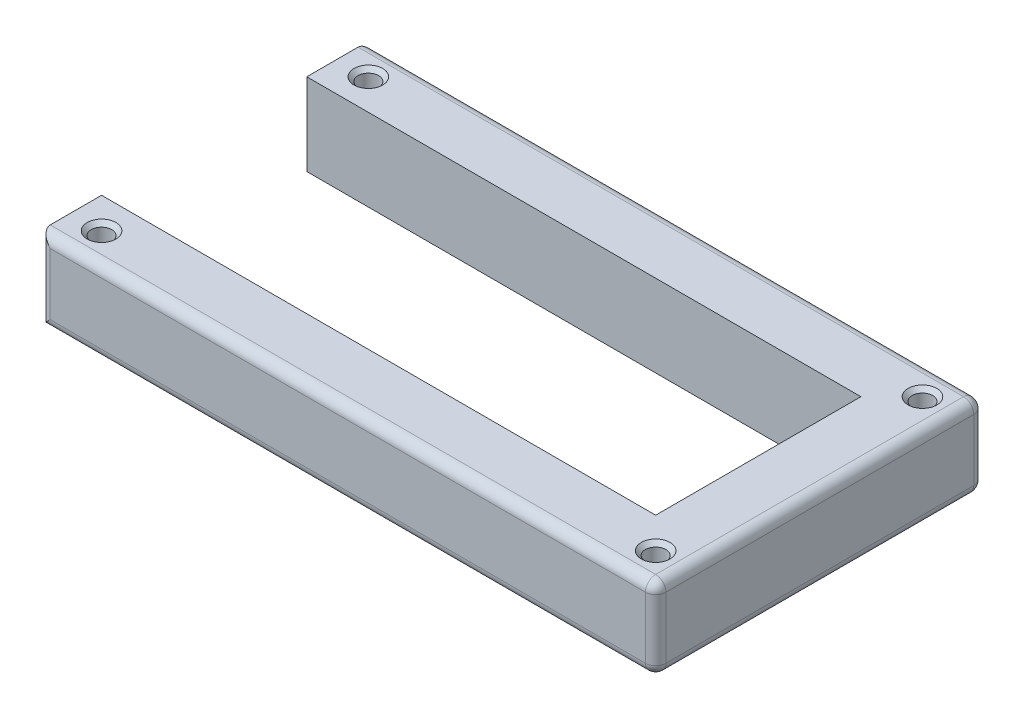
ISO-10303-21;
HEADER;
FILE_DESCRIPTION(('STEP AP214'),'2;1');
FILE_NAME('part.step','',(''),(''),'','','');
FILE_SCHEMA(('AUTOMOTIVE_DESIGN { 1 0 10303 214 1 1 1 1 }'));
ENDSEC;
DATA;
#1=APPLICATION_CONTEXT('core data for automotive mechanical design processes');
#2=APPLICATION_PROTOCOL_DEFINITION('international standard','automotive_design',2000,#1);
#3=PRODUCT_CONTEXT('',#1,'mechanical');
#4=PRODUCT('Part','Part','',(#3));
#5=PRODUCT_RELATED_PRODUCT_CATEGORY('part','',(#4));
#6=PRODUCT_DEFINITION_FORMATION('','',#4);
#7=PRODUCT_DEFINITION_CONTEXT('part definition',#1,'design');
#8=PRODUCT_DEFINITION('design','',#6,#7);
#9=PRODUCT_DEFINITION_SHAPE('','',#8);
#10=(LENGTH_UNIT() NAMED_UNIT(*) SI_UNIT(.MILLI.,.METRE.));
#11=(NAMED_UNIT(*) PLANE_ANGLE_UNIT() SI_UNIT($,.RADIAN.));
#12=(NAMED_UNIT(*) SI_UNIT($,.STERADIAN.) SOLID_ANGLE_UNIT());
#13=UNCERTAINTY_MEASURE_WITH_UNIT(LENGTH_MEASURE(1.E-05),#10,'distance_accuracy_value','');
#14=(GEOMETRIC_REPRESENTATION_CONTEXT(3) GLOBAL_UNCERTAINTY_ASSIGNED_CONTEXT((#13)) GLOBAL_UNIT_ASSIGNED_CONTEXT((#10,
#11,#12)) REPRESENTATION_CONTEXT('',''));
#15=CARTESIAN_POINT('',(0.,0.,0.));
#16=DIRECTION('',(0.,0.,1.));
#17=DIRECTION('',(1.,0.,0.));
#18=AXIS2_PLACEMENT_3D('',#15,#16,#17);
#19=CARTESIAN_POINT('',(-135.,20.,-25.));
#20=DIRECTION('',(1.,0.,0.));
#21=DIRECTION('',(0.,0.,-1.));
#22=AXIS2_PLACEMENT_3D('',#19,#20,#21);
#23=PLANE('',#22);
#24=DIRECTION('',(0.,0.,1.));
#25=VECTOR('',#24,1.);
#26=CARTESIAN_POINT('',(-135.,20.,-25.));
#27=LINE('',#26,#25);
#28=CARTESIAN_POINT('',(-135.,20.,-37.5));
#29=VERTEX_POINT('',#28);
#30=CARTESIAN_POINT('',(-135.,20.,-25.));
#31=VERTEX_POINT('',#30);
#32=EDGE_CURVE('E133',#29,#31,#27,.T.);
#33=ORIENTED_EDGE('',*,*,#32,.F.);
#34=DIRECTION('',(0.,-1.,0.));
#35=VECTOR('',#34,1.);
#36=CARTESIAN_POINT('',(-135.,20.,-37.5));
#37=LINE('',#36,#35);
#38=CARTESIAN_POINT('',(-135.,0.,-37.5));
#39=VERTEX_POINT('',#38);
#40=EDGE_CURVE('E175',#29,#39,#37,.T.);
#41=ORIENTED_EDGE('',*,*,#40,.T.);
#42=DIRECTION('',(0.,0.,1.));
#43=VECTOR('',#42,1.);
#44=CARTESIAN_POINT('',(-135.,0.,-25.));
#45=LINE('',#44,#43);
#46=CARTESIAN_POINT('',(-135.,0.,-25.));
#47=VERTEX_POINT('',#46);
#48=EDGE_CURVE('E154',#39,#47,#45,.T.);
#49=ORIENTED_EDGE('',*,*,#48,.T.);
#50=DIRECTION('',(0.,-1.,0.));
#51=VECTOR('',#50,1.);
#52=CARTESIAN_POINT('',(-135.,20.,-25.));
#53=LINE('',#52,#51);
#54=EDGE_CURVE('E147',#31,#47,#53,.T.);
#55=ORIENTED_EDGE('',*,*,#54,.F.);
#56=EDGE_LOOP('',(#33,#41,#49,#55));
#57=FACE_BOUND('',#56,.T.);
#58=ADVANCED_FACE('F33',(#57),#23,.F.);
#59=CARTESIAN_POINT('',(0.,20.,-25.));
#60=DIRECTION('',(0.,0.,-1.));
#61=DIRECTION('',(-1.,0.,0.));
#62=AXIS2_PLACEMENT_3D('',#59,#60,#61);
#63=PLANE('',#62);
#64=DIRECTION('',(1.,0.,0.));
#65=VECTOR('',#64,1.);
#66=CARTESIAN_POINT('',(0.,0.,-25.));
#67=LINE('',#66,#65);
#68=CARTESIAN_POINT('',(0.,0.,-25.));
#69=VERTEX_POINT('',#68);
#70=EDGE_CURVE('E383',#47,#69,#67,.T.);
#71=ORIENTED_EDGE('',*,*,#70,.T.);
#72=DIRECTION('',(0.,-1.,0.));
#73=VECTOR('',#72,1.);
#74=CARTESIAN_POINT('',(0.,20.,-25.));
#75=LINE('',#74,#73);
#76=CARTESIAN_POINT('',(0.,20.,-25.));
#77=VERTEX_POINT('',#76);
#78=EDGE_CURVE('E149',#77,#69,#75,.T.);
#79=ORIENTED_EDGE('',*,*,#78,.F.);
#80=DIRECTION('',(1.,0.,0.));
#81=VECTOR('',#80,1.);
#82=CARTESIAN_POINT('',(0.,20.,-25.));
#83=LINE('',#82,#81);
#84=EDGE_CURVE('E136',#31,#77,#83,.T.);
#85=ORIENTED_EDGE('',*,*,#84,.F.);
#86=ORIENTED_EDGE('',*,*,#54,.T.);
#87=EDGE_LOOP('',(#71,#79,#85,#86));
#88=FACE_BOUND('',#87,.T.);
#89=ADVANCED_FACE('F146',(#88),#63,.F.);
#90=CARTESIAN_POINT('',(0.,20.,25.));
#91=DIRECTION('',(1.,0.,0.));
#92=DIRECTION('',(0.,0.,-1.));
#93=AXIS2_PLACEMENT_3D('',#90,#91,#92);
#94=PLANE('',#93);
#95=DIRECTION('',(0.,0.,1.));
#96=VECTOR('',#95,1.);
#97=CARTESIAN_POINT('',(0.,0.,25.));
#98=LINE('',#97,#96);
#99=CARTESIAN_POINT('',(0.,0.,25.));
#100=VERTEX_POINT('',#99);
#101=EDGE_CURVE('E385',#69,#100,#98,.T.);
#102=ORIENTED_EDGE('',*,*,#101,.T.);
#103=DIRECTION('',(0.,-1.,0.));
#104=VECTOR('',#103,1.);
#105=CARTESIAN_POINT('',(0.,20.,25.));
#106=LINE('',#105,#104);
#107=CARTESIAN_POINT('',(0.,20.,25.));
#108=VERTEX_POINT('',#107);
#109=EDGE_CURVE('E160',#108,#100,#106,.T.);
#110=ORIENTED_EDGE('',*,*,#109,.F.);
#111=DIRECTION('',(0.,0.,1.));
#112=VECTOR('',#111,1.);
#113=CARTESIAN_POINT('',(0.,20.,25.));
#114=LINE('',#113,#112);
#115=EDGE_CURVE('E151',#77,#108,#114,.T.);
#116=ORIENTED_EDGE('',*,*,#115,.F.);
#117=ORIENTED_EDGE('',*,*,#78,.T.);
#118=EDGE_LOOP('',(#102,#110,#116,#117));
#119=FACE_BOUND('',#118,.T.);
#120=ADVANCED_FACE('F286',(#119),#94,.F.);
#121=CARTESIAN_POINT('',(0.,20.,25.));
#122=DIRECTION('',(0.,0.,1.));
#123=DIRECTION('',(1.,0.,0.));
#124=AXIS2_PLACEMENT_3D('',#121,#122,#123);
#125=PLANE('',#124);
#126=DIRECTION('',(-1.,0.,0.));
#127=VECTOR('',#126,1.);
#128=CARTESIAN_POINT('',(0.,0.,25.));
#129=LINE('',#128,#127);
#130=CARTESIAN_POINT('',(-135.,0.,25.));
#131=VERTEX_POINT('',#130);
#132=EDGE_CURVE('E387',#100,#131,#129,.T.);
#133=ORIENTED_EDGE('',*,*,#132,.T.);
#134=DIRECTION('',(0.,-1.,0.));
#135=VECTOR('',#134,1.);
#136=CARTESIAN_POINT('',(-135.,20.,25.));
#137=LINE('',#136,#135);
#138=CARTESIAN_POINT('',(-135.,20.,25.));
#139=VERTEX_POINT('',#138);
#140=EDGE_CURVE('E381',#139,#131,#137,.T.);
#141=ORIENTED_EDGE('',*,*,#140,.F.);
#142=DIRECTION('',(-1.,0.,0.));
#143=VECTOR('',#142,1.);
#144=CARTESIAN_POINT('',(0.,20.,25.));
#145=LINE('',#144,#143);
#146=EDGE_CURVE('E376',#108,#139,#145,.T.);
#147=ORIENTED_EDGE('',*,*,#146,.F.);
#148=ORIENTED_EDGE('',*,*,#109,.T.);
#149=EDGE_LOOP('',(#133,#141,#147,#148));
#150=FACE_BOUND('',#149,.T.);
#151=ADVANCED_FACE('F397',(#150),#125,.F.);
#152=CARTESIAN_POINT('',(-135.,20.,25.));
#153=DIRECTION('',(1.,0.,0.));
#154=DIRECTION('',(0.,0.,-1.));
#155=AXIS2_PLACEMENT_3D('',#152,#153,#154);
#156=PLANE('',#155);
#157=DIRECTION('',(0.,0.,1.));
#158=VECTOR('',#157,1.);
#159=CARTESIAN_POINT('',(-135.,0.,25.));
#160=LINE('',#159,#158);
#161=CARTESIAN_POINT('',(-135.,0.,37.5));
#162=VERTEX_POINT('',#161);
#163=EDGE_CURVE('E142',#131,#162,#160,.T.);
#164=ORIENTED_EDGE('',*,*,#163,.T.);
#165=DIRECTION('',(0.,-1.,0.));
#166=VECTOR('',#165,1.);
#167=CARTESIAN_POINT('',(-135.,20.,37.5));
#168=LINE('',#167,#166);
#169=CARTESIAN_POINT('',(-135.,20.,37.5));
#170=VERTEX_POINT('',#169);
#171=EDGE_CURVE('E198',#162,#170,#168,.F.);
#172=ORIENTED_EDGE('',*,*,#171,.T.);
#173=DIRECTION('',(0.,0.,1.));
#174=VECTOR('',#173,1.);
#175=CARTESIAN_POINT('',(-135.,20.,25.));
#176=LINE('',#175,#174);
#177=EDGE_CURVE('E378',#139,#170,#176,.T.);
#178=ORIENTED_EDGE('',*,*,#177,.F.);
#179=ORIENTED_EDGE('',*,*,#140,.T.);
#180=EDGE_LOOP('',(#164,#172,#178,#179));
#181=FACE_BOUND('',#180,.T.);
#182=ADVANCED_FACE('F406',(#181),#156,.F.);
#183=CARTESIAN_POINT('',(15.,20.,40.));
#184=DIRECTION('',(0.,0.,-1.));
#185=DIRECTION('',(-1.,0.,0.));
#186=AXIS2_PLACEMENT_3D('',#183,#184,#185);
#187=PLANE('',#186);
#188=DIRECTION('',(1.,0.,0.));
#189=VECTOR('',#188,1.);
#190=CARTESIAN_POINT('',(-135.,17.5,40.));
#191=LINE('',#190,#189);
#192=CARTESIAN_POINT('',(12.5,17.5,40.));
#193=VERTEX_POINT('',#192);
#194=CARTESIAN_POINT('',(-132.5,17.5,40.));
#195=VERTEX_POINT('',#194);
#196=EDGE_CURVE('E48',#193,#195,#191,.F.);
#197=ORIENTED_EDGE('',*,*,#196,.T.);
#198=DIRECTION('',(0.,-1.,0.));
#199=VECTOR('',#198,1.);
#200=CARTESIAN_POINT('',(-132.5,20.,40.));
#201=LINE('',#200,#199);
#202=CARTESIAN_POINT('',(-132.5,2.5,40.));
#203=VERTEX_POINT('',#202);
#204=EDGE_CURVE('E196',#195,#203,#201,.T.);
#205=ORIENTED_EDGE('',*,*,#204,.T.);
#206=DIRECTION('',(1.,0.,0.));
#207=VECTOR('',#206,1.);
#208=CARTESIAN_POINT('',(15.,2.5,40.));
#209=LINE('',#208,#207);
#210=CARTESIAN_POINT('',(12.5,2.5,40.));
#211=VERTEX_POINT('',#210);
#212=EDGE_CURVE('E192',#203,#211,#209,.T.);
#213=ORIENTED_EDGE('',*,*,#212,.T.);
#214=DIRECTION('',(0.,-1.,0.));
#215=VECTOR('',#214,1.);
#216=CARTESIAN_POINT('',(12.5,20.,40.));
#217=LINE('',#216,#215);
#218=EDGE_CURVE('E53',#211,#193,#217,.F.);
#219=ORIENTED_EDGE('',*,*,#218,.T.);
#220=EDGE_LOOP('',(#197,#205,#213,#219));
#221=FACE_BOUND('',#220,.T.);
#222=ADVANCED_FACE('F425',(#221),#187,.F.);
#223=CARTESIAN_POINT('',(15.,20.,40.));
#224=DIRECTION('',(-1.,0.,0.));
#225=DIRECTION('',(0.,0.,1.));
#226=AXIS2_PLACEMENT_3D('',#223,#224,#225);
#227=PLANE('',#226);
#228=DIRECTION('',(0.,-1.,0.));
#229=VECTOR('',#228,1.);
#230=CARTESIAN_POINT('',(15.,20.,-37.5));
#231=LINE('',#230,#229);
#232=CARTESIAN_POINT('',(15.,2.5,-37.5));
#233=VERTEX_POINT('',#232);
#234=CARTESIAN_POINT('',(15.,17.5,-37.5));
#235=VERTEX_POINT('',#234);
#236=EDGE_CURVE('E187',#233,#235,#231,.F.);
#237=ORIENTED_EDGE('',*,*,#236,.T.);
#238=DIRECTION('',(0.,0.,-1.));
#239=VECTOR('',#238,1.);
#240=CARTESIAN_POINT('',(15.,17.5,40.));
#241=LINE('',#240,#239);
#242=CARTESIAN_POINT('',(15.,17.5,37.5));
#243=VERTEX_POINT('',#242);
#244=EDGE_CURVE('E189',#235,#243,#241,.F.);
#245=ORIENTED_EDGE('',*,*,#244,.T.);
#246=DIRECTION('',(0.,-1.,0.));
#247=VECTOR('',#246,1.);
#248=CARTESIAN_POINT('',(15.,20.,37.5));
#249=LINE('',#248,#247);
#250=CARTESIAN_POINT('',(15.,2.5,37.5));
#251=VERTEX_POINT('',#250);
#252=EDGE_CURVE('E183',#243,#251,#249,.T.);
#253=ORIENTED_EDGE('',*,*,#252,.T.);
#254=DIRECTION('',(0.,0.,-1.));
#255=VECTOR('',#254,1.);
#256=CARTESIAN_POINT('',(15.,2.5,40.));
#257=LINE('',#256,#255);
#258=EDGE_CURVE('E185',#251,#233,#257,.T.);
#259=ORIENTED_EDGE('',*,*,#258,.T.);
#260=EDGE_LOOP('',(#237,#245,#253,#259));
#261=FACE_BOUND('',#260,.T.);
#262=ADVANCED_FACE('F428',(#261),#227,.F.);
#263=CARTESIAN_POINT('',(15.,20.,-40.));
#264=DIRECTION('',(0.,0.,1.));
#265=DIRECTION('',(1.,0.,0.));
#266=AXIS2_PLACEMENT_3D('',#263,#264,#265);
#267=PLANE('',#266);
#268=DIRECTION('',(0.,-1.,0.));
#269=VECTOR('',#268,1.);
#270=CARTESIAN_POINT('',(-132.5,20.,-40.));
#271=LINE('',#270,#269);
#272=CARTESIAN_POINT('',(-132.5,2.5,-40.));
#273=VERTEX_POINT('',#272);
#274=CARTESIAN_POINT('',(-132.5,17.5,-40.));
#275=VERTEX_POINT('',#274);
#276=EDGE_CURVE('E170',#273,#275,#271,.F.);
#277=ORIENTED_EDGE('',*,*,#276,.T.);
#278=DIRECTION('',(-1.,0.,0.));
#279=VECTOR('',#278,1.);
#280=CARTESIAN_POINT('',(15.,17.5,-40.));
#281=LINE('',#280,#279);
#282=CARTESIAN_POINT('',(12.5,17.5,-40.));
#283=VERTEX_POINT('',#282);
#284=EDGE_CURVE('E172',#275,#283,#281,.F.);
#285=ORIENTED_EDGE('',*,*,#284,.T.);
#286=DIRECTION('',(0.,-1.,0.));
#287=VECTOR('',#286,1.);
#288=CARTESIAN_POINT('',(12.5,20.,-40.));
#289=LINE('',#288,#287);
#290=CARTESIAN_POINT('',(12.5,2.5,-40.));
#291=VERTEX_POINT('',#290);
#292=EDGE_CURVE('E166',#283,#291,#289,.T.);
#293=ORIENTED_EDGE('',*,*,#292,.T.);
#294=DIRECTION('',(-1.,0.,0.));
#295=VECTOR('',#294,1.);
#296=CARTESIAN_POINT('',(15.,2.5,-40.));
#297=LINE('',#296,#295);
#298=EDGE_CURVE('E168',#291,#273,#297,.T.);
#299=ORIENTED_EDGE('',*,*,#298,.T.);
#300=EDGE_LOOP('',(#277,#285,#293,#299));
#301=FACE_BOUND('',#300,.T.);
#302=ADVANCED_FACE('F431',(#301),#267,.F.);
#303=CARTESIAN_POINT('',(0.,20.,0.));
#304=DIRECTION('',(0.,1.,0.));
#305=DIRECTION('',(0.,0.,1.));
#306=AXIS2_PLACEMENT_3D('',#303,#304,#305);
#307=PLANE('',#306);
#308=CARTESIAN_POINT('',(7.49999999999998,20.,-32.5));
#309=DIRECTION('',(0.,1.,0.));
#310=DIRECTION('',(0.,0.,1.));
#311=AXIS2_PLACEMENT_3D('',#308,#309,#310);
#312=CIRCLE('',#311,3.49999999999999);
#313=CARTESIAN_POINT('',(7.49999999999998,20.,-29.));
#314=VERTEX_POINT('',#313);
#315=EDGE_CURVE('E257',#314,#314,#312,.F.);
#316=ORIENTED_EDGE('',*,*,#315,.T.);
#317=EDGE_LOOP('',(#316));
#318=FACE_BOUND('',#317,.T.);
#319=CARTESIAN_POINT('',(7.49999999999998,20.,32.5));
#320=DIRECTION('',(0.,1.,0.));
#321=DIRECTION('',(0.,0.,1.));
#322=AXIS2_PLACEMENT_3D('',#319,#320,#321);
#323=CIRCLE('',#322,3.49999999999999);
#324=CARTESIAN_POINT('',(7.49999999999998,20.,36.));
#325=VERTEX_POINT('',#324);
#326=EDGE_CURVE('E254',#325,#325,#323,.F.);
#327=ORIENTED_EDGE('',*,*,#326,.T.);
#328=EDGE_LOOP('',(#327));
#329=FACE_BOUND('',#328,.T.);
#330=CARTESIAN_POINT('',(-127.5,20.,32.5));
#331=DIRECTION('',(0.,1.,0.));
#332=DIRECTION('',(0.,0.,1.));
#333=AXIS2_PLACEMENT_3D('',#330,#331,#332);
#334=CIRCLE('',#333,3.49999999999999);
#335=CARTESIAN_POINT('',(-127.5,20.,36.));
#336=VERTEX_POINT('',#335);
#337=EDGE_CURVE('E251',#336,#336,#334,.F.);
#338=ORIENTED_EDGE('',*,*,#337,.T.);
#339=EDGE_LOOP('',(#338));
#340=FACE_BOUND('',#339,.T.);
#341=CARTESIAN_POINT('',(-127.5,20.,-32.5));
#342=DIRECTION('',(0.,1.,0.));
#343=DIRECTION('',(0.,0.,1.));
#344=AXIS2_PLACEMENT_3D('',#341,#342,#343);
#345=CIRCLE('',#344,3.49999999999999);
#346=CARTESIAN_POINT('',(-127.5,20.,-29.));
#347=VERTEX_POINT('',#346);
#348=EDGE_CURVE('E248',#347,#347,#345,.F.);
#349=ORIENTED_EDGE('',*,*,#348,.T.);
#350=EDGE_LOOP('',(#349));
#351=FACE_BOUND('',#350,.T.);
#352=DIRECTION('',(0.,0.,-1.));
#353=VECTOR('',#352,1.);
#354=CARTESIAN_POINT('',(12.5,20.,-40.));
#355=LINE('',#354,#353);
#356=CARTESIAN_POINT('',(12.5,20.,37.5));
#357=VERTEX_POINT('',#356);
#358=CARTESIAN_POINT('',(12.5,20.,-37.5));
#359=VERTEX_POINT('',#358);
#360=EDGE_CURVE('E158',#357,#359,#355,.T.);
#361=ORIENTED_EDGE('',*,*,#360,.T.);
#362=DIRECTION('',(-1.,0.,0.));
#363=VECTOR('',#362,1.);
#364=CARTESIAN_POINT('',(-135.,20.,-37.5));
#365=LINE('',#364,#363);
#366=EDGE_CURVE('E139',#359,#29,#365,.T.);
#367=ORIENTED_EDGE('',*,*,#366,.T.);
#368=ORIENTED_EDGE('',*,*,#32,.T.);
#369=ORIENTED_EDGE('',*,*,#84,.T.);
#370=ORIENTED_EDGE('',*,*,#115,.T.);
#371=ORIENTED_EDGE('',*,*,#146,.T.);
#372=ORIENTED_EDGE('',*,*,#177,.T.);
#373=DIRECTION('',(1.,0.,0.));
#374=VECTOR('',#373,1.);
#375=CARTESIAN_POINT('',(15.,20.,37.5));
#376=LINE('',#375,#374);
#377=EDGE_CURVE('E156',#170,#357,#376,.T.);
#378=ORIENTED_EDGE('',*,*,#377,.T.);
#379=EDGE_LOOP('',(#361,#367,#368,#369,#370,#371,#372,#378));
#380=FACE_BOUND('',#379,.T.);
#381=ADVANCED_FACE('F135',(#318,#329,#340,#351,#380),#307,.T.);
#382=CARTESIAN_POINT('',(0.,0.,0.));
#383=DIRECTION('',(0.,1.,0.));
#384=DIRECTION('',(0.,0.,1.));
#385=AXIS2_PLACEMENT_3D('',#382,#383,#384);
#386=PLANE('',#385);
#387=CARTESIAN_POINT('',(7.49999999999998,0.,32.5));
#388=DIRECTION('',(0.,1.,0.));
#389=DIRECTION('',(0.,0.,-1.));
#390=AXIS2_PLACEMENT_3D('',#387,#388,#389);
#391=CIRCLE('',#390,2.5);
#392=CARTESIAN_POINT('',(7.49999999999998,0.,30.));
#393=VERTEX_POINT('',#392);
#394=EDGE_CURVE('E368',#393,#393,#391,.T.);
#395=ORIENTED_EDGE('',*,*,#394,.T.);
#396=EDGE_LOOP('',(#395));
#397=FACE_BOUND('',#396,.T.);
#398=CARTESIAN_POINT('',(-127.5,0.,-32.5));
#399=DIRECTION('',(0.,1.,0.));
#400=DIRECTION('',(0.,0.,1.));
#401=AXIS2_PLACEMENT_3D('',#398,#399,#400);
#402=CIRCLE('',#401,2.5);
#403=CARTESIAN_POINT('',(-127.5,0.,-30.));
#404=VERTEX_POINT('',#403);
#405=EDGE_CURVE('E371',#404,#404,#402,.T.);
#406=ORIENTED_EDGE('',*,*,#405,.T.);
#407=EDGE_LOOP('',(#406));
#408=FACE_BOUND('',#407,.T.);
#409=CARTESIAN_POINT('',(-127.5,0.,32.5));
#410=DIRECTION('',(0.,1.,0.));
#411=DIRECTION('',(0.,0.,1.));
#412=AXIS2_PLACEMENT_3D('',#409,#410,#411);
#413=CIRCLE('',#412,2.5);
#414=CARTESIAN_POINT('',(-127.5,0.,35.));
#415=VERTEX_POINT('',#414);
#416=EDGE_CURVE('E634',#415,#415,#413,.T.);
#417=ORIENTED_EDGE('',*,*,#416,.T.);
#418=EDGE_LOOP('',(#417));
#419=FACE_BOUND('',#418,.T.);
#420=CARTESIAN_POINT('',(7.49999999999998,0.,-32.5));
#421=DIRECTION('',(0.,1.,0.));
#422=DIRECTION('',(0.,0.,1.));
#423=AXIS2_PLACEMENT_3D('',#420,#421,#422);
#424=CIRCLE('',#423,2.5);
#425=CARTESIAN_POINT('',(7.49999999999998,0.,-30.));
#426=VERTEX_POINT('',#425);
#427=EDGE_CURVE('E204',#426,#426,#424,.T.);
#428=ORIENTED_EDGE('',*,*,#427,.T.);
#429=EDGE_LOOP('',(#428));
#430=FACE_BOUND('',#429,.T.);
#431=ORIENTED_EDGE('',*,*,#48,.F.);
#432=DIRECTION('',(-1.,0.,0.));
#433=VECTOR('',#432,1.);
#434=CARTESIAN_POINT('',(0.,0.,-37.5));
#435=LINE('',#434,#433);
#436=CARTESIAN_POINT('',(12.5,0.,-37.5));
#437=VERTEX_POINT('',#436);
#438=EDGE_CURVE('E181',#39,#437,#435,.F.);
#439=ORIENTED_EDGE('',*,*,#438,.T.);
#440=DIRECTION('',(0.,0.,-1.));
#441=VECTOR('',#440,1.);
#442=CARTESIAN_POINT('',(12.5,0.,0.));
#443=LINE('',#442,#441);
#444=CARTESIAN_POINT('',(12.5,0.,37.5));
#445=VERTEX_POINT('',#444);
#446=EDGE_CURVE('E179',#437,#445,#443,.F.);
#447=ORIENTED_EDGE('',*,*,#446,.T.);
#448=DIRECTION('',(1.,0.,0.));
#449=VECTOR('',#448,1.);
#450=CARTESIAN_POINT('',(0.,0.,37.5));
#451=LINE('',#450,#449);
#452=EDGE_CURVE('E177',#445,#162,#451,.F.);
#453=ORIENTED_EDGE('',*,*,#452,.T.);
#454=ORIENTED_EDGE('',*,*,#163,.F.);
#455=ORIENTED_EDGE('',*,*,#132,.F.);
#456=ORIENTED_EDGE('',*,*,#101,.F.);
#457=ORIENTED_EDGE('',*,*,#70,.F.);
#458=EDGE_LOOP('',(#431,#439,#447,#453,#454,#455,#456,#457));
#459=FACE_BOUND('',#458,.T.);
#460=ADVANCED_FACE('F346',(#397,#408,#419,#430,#459),#386,.F.);
#461=CARTESIAN_POINT('',(15.,2.5,37.5));
#462=DIRECTION('',(1.,0.,0.));
#463=DIRECTION('',(0.,0.,-1.));
#464=AXIS2_PLACEMENT_3D('',#461,#462,#463);
#465=CYLINDRICAL_SURFACE('',#464,2.5);
#466=CARTESIAN_POINT('',(12.5,2.5,37.5));
#467=DIRECTION('',(1.,0.,0.));
#468=DIRECTION('',(0.,0.,-1.));
#469=AXIS2_PLACEMENT_3D('',#466,#467,#468);
#470=CIRCLE('',#469,2.5);
#471=EDGE_CURVE('E241',#211,#445,#470,.T.);
#472=ORIENTED_EDGE('',*,*,#471,.F.);
#473=ORIENTED_EDGE('',*,*,#212,.F.);
#474=CARTESIAN_POINT('',(-132.5,2.5,37.5));
#475=DIRECTION('',(0.707106781186547,-0.707106781186547,0.));
#476=DIRECTION('',(0.707106781186547,0.707106781186547,0.));
#477=AXIS2_PLACEMENT_3D('',#474,#475,#476);
#478=ELLIPSE('',#477,3.53553390593274,2.5);
#479=EDGE_CURVE('E244',#162,#203,#478,.F.);
#480=ORIENTED_EDGE('',*,*,#479,.F.);
#481=ORIENTED_EDGE('',*,*,#452,.F.);
#482=EDGE_LOOP('',(#472,#473,#480,#481));
#483=FACE_BOUND('',#482,.T.);
#484=ADVANCED_FACE('F342',(#483),#465,.T.);
#485=CARTESIAN_POINT('',(-132.5,20.,37.5));
#486=DIRECTION('',(0.,-1.,0.));
#487=DIRECTION('',(0.,0.,-1.));
#488=AXIS2_PLACEMENT_3D('',#485,#486,#487);
#489=CYLINDRICAL_SURFACE('',#488,2.5);
#490=ORIENTED_EDGE('',*,*,#479,.T.);
#491=ORIENTED_EDGE('',*,*,#204,.F.);
#492=CARTESIAN_POINT('',(-132.5,17.5,37.5));
#493=DIRECTION('',(-0.707106781186547,-0.707106781186547,0.));
#494=DIRECTION('',(-0.707106781186547,0.707106781186547,0.));
#495=AXIS2_PLACEMENT_3D('',#492,#493,#494);
#496=ELLIPSE('',#495,3.53553390593274,2.5);
#497=EDGE_CURVE('E235',#170,#195,#496,.F.);
#498=ORIENTED_EDGE('',*,*,#497,.F.);
#499=ORIENTED_EDGE('',*,*,#171,.F.);
#500=EDGE_LOOP('',(#490,#491,#498,#499));
#501=FACE_BOUND('',#500,.T.);
#502=ADVANCED_FACE('F338',(#501),#489,.T.);
#503=CARTESIAN_POINT('',(12.5,2.5,37.5));
#504=DIRECTION('',(0.,0.,1.));
#505=DIRECTION('',(1.,0.,0.));
#506=AXIS2_PLACEMENT_3D('',#503,#504,#505);
#507=SPHERICAL_SURFACE('',#506,2.5);
#508=CARTESIAN_POINT('',(12.5,2.5,37.5));
#509=DIRECTION('',(0.,0.,1.));
#510=DIRECTION('',(1.,0.,0.));
#511=AXIS2_PLACEMENT_3D('',#508,#509,#510);
#512=CIRCLE('',#511,2.5);
#513=EDGE_CURVE('E232',#251,#445,#512,.F.);
#514=ORIENTED_EDGE('',*,*,#513,.F.);
#515=CARTESIAN_POINT('',(12.5,2.5,37.5));
#516=DIRECTION('',(0.,-1.,0.));
#517=DIRECTION('',(0.,0.,-1.));
#518=AXIS2_PLACEMENT_3D('',#515,#516,#517);
#519=CIRCLE('',#518,2.5);
#520=EDGE_CURVE('E238',#211,#251,#519,.F.);
#521=ORIENTED_EDGE('',*,*,#520,.F.);
#522=ORIENTED_EDGE('',*,*,#471,.T.);
#523=EDGE_LOOP('',(#514,#521,#522));
#524=FACE_BOUND('',#523,.T.);
#525=ADVANCED_FACE('F334',(#524),#507,.T.);
#526=CARTESIAN_POINT('',(12.5,20.,37.5));
#527=DIRECTION('',(0.,-1.,0.));
#528=DIRECTION('',(0.,0.,-1.));
#529=AXIS2_PLACEMENT_3D('',#526,#527,#528);
#530=CYLINDRICAL_SURFACE('',#529,2.5);
#531=ORIENTED_EDGE('',*,*,#520,.T.);
#532=ORIENTED_EDGE('',*,*,#252,.F.);
#533=CARTESIAN_POINT('',(12.5,17.5,37.5));
#534=DIRECTION('',(0.,1.,0.));
#535=DIRECTION('',(0.,0.,1.));
#536=AXIS2_PLACEMENT_3D('',#533,#534,#535);
#537=CIRCLE('',#536,2.5);
#538=EDGE_CURVE('E229',#193,#243,#537,.T.);
#539=ORIENTED_EDGE('',*,*,#538,.F.);
#540=ORIENTED_EDGE('',*,*,#218,.F.);
#541=EDGE_LOOP('',(#531,#532,#539,#540));
#542=FACE_BOUND('',#541,.T.);
#543=ADVANCED_FACE('F330',(#542),#530,.T.);
#544=CARTESIAN_POINT('',(0.,17.5,37.5));
#545=DIRECTION('',(-1.,0.,0.));
#546=DIRECTION('',(0.,0.,1.));
#547=AXIS2_PLACEMENT_3D('',#544,#545,#546);
#548=CYLINDRICAL_SURFACE('',#547,2.5);
#549=ORIENTED_EDGE('',*,*,#497,.T.);
#550=ORIENTED_EDGE('',*,*,#196,.F.);
#551=CARTESIAN_POINT('',(12.5,17.5,37.5));
#552=DIRECTION('',(1.,0.,0.));
#553=DIRECTION('',(0.,0.,-1.));
#554=AXIS2_PLACEMENT_3D('',#551,#552,#553);
#555=CIRCLE('',#554,2.5);
#556=EDGE_CURVE('E226',#357,#193,#555,.T.);
#557=ORIENTED_EDGE('',*,*,#556,.F.);
#558=ORIENTED_EDGE('',*,*,#377,.F.);
#559=EDGE_LOOP('',(#549,#550,#557,#558));
#560=FACE_BOUND('',#559,.T.);
#561=ADVANCED_FACE('F326',(#560),#548,.T.);
#562=CARTESIAN_POINT('',(12.5,2.5,40.));
#563=DIRECTION('',(0.,0.,-1.));
#564=DIRECTION('',(-1.,0.,0.));
#565=AXIS2_PLACEMENT_3D('',#562,#563,#564);
#566=CYLINDRICAL_SURFACE('',#565,2.5);
#567=ORIENTED_EDGE('',*,*,#513,.T.);
#568=ORIENTED_EDGE('',*,*,#446,.F.);
#569=CARTESIAN_POINT('',(12.5,2.5,-37.5));
#570=DIRECTION('',(0.,0.,-1.));
#571=DIRECTION('',(-1.,0.,0.));
#572=AXIS2_PLACEMENT_3D('',#569,#570,#571);
#573=CIRCLE('',#572,2.5);
#574=EDGE_CURVE('E223',#233,#437,#573,.T.);
#575=ORIENTED_EDGE('',*,*,#574,.F.);
#576=ORIENTED_EDGE('',*,*,#258,.F.);
#577=EDGE_LOOP('',(#567,#568,#575,#576));
#578=FACE_BOUND('',#577,.T.);
#579=ADVANCED_FACE('F322',(#578),#566,.T.);
#580=CARTESIAN_POINT('',(12.5,17.5,37.5));
#581=DIRECTION('',(0.,0.,1.));
#582=DIRECTION('',(1.,0.,0.));
#583=AXIS2_PLACEMENT_3D('',#580,#581,#582);
#584=SPHERICAL_SURFACE('',#583,2.5);
#585=ORIENTED_EDGE('',*,*,#556,.T.);
#586=ORIENTED_EDGE('',*,*,#538,.T.);
#587=CARTESIAN_POINT('',(12.5,17.5,37.5));
#588=DIRECTION('',(0.,0.,1.));
#589=DIRECTION('',(1.,0.,0.));
#590=AXIS2_PLACEMENT_3D('',#587,#588,#589);
#591=CIRCLE('',#590,2.5);
#592=EDGE_CURVE('E218',#357,#243,#591,.F.);
#593=ORIENTED_EDGE('',*,*,#592,.F.);
#594=EDGE_LOOP('',(#585,#586,#593));
#595=FACE_BOUND('',#594,.T.);
#596=ADVANCED_FACE('F318',(#595),#584,.T.);
#597=CARTESIAN_POINT('',(12.5,2.5,-37.5));
#598=DIRECTION('',(0.,0.,1.));
#599=DIRECTION('',(1.,0.,0.));
#600=AXIS2_PLACEMENT_3D('',#597,#598,#599);
#601=SPHERICAL_SURFACE('',#600,2.5);
#602=CARTESIAN_POINT('',(12.5,2.5,-37.5));
#603=DIRECTION('',(1.,0.,0.));
#604=DIRECTION('',(0.,0.,-1.));
#605=AXIS2_PLACEMENT_3D('',#602,#603,#604);
#606=CIRCLE('',#605,2.5);
#607=EDGE_CURVE('E215',#291,#437,#606,.F.);
#608=ORIENTED_EDGE('',*,*,#607,.F.);
#609=CARTESIAN_POINT('',(12.5,2.5,-37.5));
#610=DIRECTION('',(0.,-1.,0.));
#611=DIRECTION('',(0.,0.,-1.));
#612=AXIS2_PLACEMENT_3D('',#609,#610,#611);
#613=CIRCLE('',#612,2.5);
#614=EDGE_CURVE('E220',#233,#291,#613,.F.);
#615=ORIENTED_EDGE('',*,*,#614,.F.);
#616=ORIENTED_EDGE('',*,*,#574,.T.);
#617=EDGE_LOOP('',(#608,#615,#616));
#618=FACE_BOUND('',#617,.T.);
#619=ADVANCED_FACE('F314',(#618),#601,.T.);
#620=CARTESIAN_POINT('',(12.5,20.,-37.5));
#621=DIRECTION('',(0.,-1.,0.));
#622=DIRECTION('',(0.,0.,-1.));
#623=AXIS2_PLACEMENT_3D('',#620,#621,#622);
#624=CYLINDRICAL_SURFACE('',#623,2.5);
#625=ORIENTED_EDGE('',*,*,#614,.T.);
#626=ORIENTED_EDGE('',*,*,#292,.F.);
#627=CARTESIAN_POINT('',(12.5,17.5,-37.5));
#628=DIRECTION('',(0.,1.,0.));
#629=DIRECTION('',(0.,0.,1.));
#630=AXIS2_PLACEMENT_3D('',#627,#628,#629);
#631=CIRCLE('',#630,2.5);
#632=EDGE_CURVE('E212',#235,#283,#631,.T.);
#633=ORIENTED_EDGE('',*,*,#632,.F.);
#634=ORIENTED_EDGE('',*,*,#236,.F.);
#635=EDGE_LOOP('',(#625,#626,#633,#634));
#636=FACE_BOUND('',#635,.T.);
#637=ADVANCED_FACE('F310',(#636),#624,.T.);
#638=CARTESIAN_POINT('',(12.5,17.5,0.));
#639=DIRECTION('',(0.,0.,1.));
#640=DIRECTION('',(1.,0.,0.));
#641=AXIS2_PLACEMENT_3D('',#638,#639,#640);
#642=CYLINDRICAL_SURFACE('',#641,2.5);
#643=ORIENTED_EDGE('',*,*,#592,.T.);
#644=ORIENTED_EDGE('',*,*,#244,.F.);
#645=CARTESIAN_POINT('',(12.5,17.5,-37.5));
#646=DIRECTION('',(0.,0.,-1.));
#647=DIRECTION('',(-1.,0.,0.));
#648=AXIS2_PLACEMENT_3D('',#645,#646,#647);
#649=CIRCLE('',#648,2.5);
#650=EDGE_CURVE('E209',#359,#235,#649,.T.);
#651=ORIENTED_EDGE('',*,*,#650,.F.);
#652=ORIENTED_EDGE('',*,*,#360,.F.);
#653=EDGE_LOOP('',(#643,#644,#651,#652));
#654=FACE_BOUND('',#653,.T.);
#655=ADVANCED_FACE('F306',(#654),#642,.T.);
#656=CARTESIAN_POINT('',(15.,2.5,-37.5));
#657=DIRECTION('',(-1.,0.,0.));
#658=DIRECTION('',(0.,0.,1.));
#659=AXIS2_PLACEMENT_3D('',#656,#657,#658);
#660=CYLINDRICAL_SURFACE('',#659,2.5);
#661=ORIENTED_EDGE('',*,*,#607,.T.);
#662=ORIENTED_EDGE('',*,*,#438,.F.);
#663=CARTESIAN_POINT('',(-132.5,2.5,-37.5));
#664=DIRECTION('',(-0.707106781186547,0.707106781186547,0.));
#665=DIRECTION('',(-0.707106781186547,-0.707106781186547,0.));
#666=AXIS2_PLACEMENT_3D('',#663,#664,#665);
#667=ELLIPSE('',#666,3.53553390593274,2.5);
#668=EDGE_CURVE('E206',#273,#39,#667,.T.);
#669=ORIENTED_EDGE('',*,*,#668,.F.);
#670=ORIENTED_EDGE('',*,*,#298,.F.);
#671=EDGE_LOOP('',(#661,#662,#669,#670));
#672=FACE_BOUND('',#671,.T.);
#673=ADVANCED_FACE('F302',(#672),#660,.T.);
#674=CARTESIAN_POINT('',(12.5,17.5,-37.5));
#675=DIRECTION('',(0.,0.,1.));
#676=DIRECTION('',(1.,0.,0.));
#677=AXIS2_PLACEMENT_3D('',#674,#675,#676);
#678=SPHERICAL_SURFACE('',#677,2.5);
#679=ORIENTED_EDGE('',*,*,#650,.T.);
#680=ORIENTED_EDGE('',*,*,#632,.T.);
#681=CARTESIAN_POINT('',(12.5,17.5,-37.5));
#682=DIRECTION('',(1.,0.,0.));
#683=DIRECTION('',(0.,0.,-1.));
#684=AXIS2_PLACEMENT_3D('',#681,#682,#683);
#685=CIRCLE('',#684,2.5);
#686=EDGE_CURVE('E203',#359,#283,#685,.F.);
#687=ORIENTED_EDGE('',*,*,#686,.F.);
#688=EDGE_LOOP('',(#679,#680,#687));
#689=FACE_BOUND('',#688,.T.);
#690=ADVANCED_FACE('F298',(#689),#678,.T.);
#691=CARTESIAN_POINT('',(-132.5,20.,-37.5));
#692=DIRECTION('',(0.,-1.,0.));
#693=DIRECTION('',(0.,0.,-1.));
#694=AXIS2_PLACEMENT_3D('',#691,#692,#693);
#695=CYLINDRICAL_SURFACE('',#694,2.5);
#696=ORIENTED_EDGE('',*,*,#668,.T.);
#697=ORIENTED_EDGE('',*,*,#40,.F.);
#698=CARTESIAN_POINT('',(-132.5,17.5,-37.5));
#699=DIRECTION('',(-0.707106781186547,-0.707106781186547,0.));
#700=DIRECTION('',(0.707106781186547,-0.707106781186547,0.));
#701=AXIS2_PLACEMENT_3D('',#698,#699,#700);
#702=ELLIPSE('',#701,3.53553390593274,2.5);
#703=EDGE_CURVE('E201',#275,#29,#702,.F.);
#704=ORIENTED_EDGE('',*,*,#703,.F.);
#705=ORIENTED_EDGE('',*,*,#276,.F.);
#706=EDGE_LOOP('',(#696,#697,#704,#705));
#707=FACE_BOUND('',#706,.T.);
#708=ADVANCED_FACE('F294',(#707),#695,.T.);
#709=CARTESIAN_POINT('',(0.,17.5,-37.5));
#710=DIRECTION('',(1.,0.,0.));
#711=DIRECTION('',(0.,0.,-1.));
#712=AXIS2_PLACEMENT_3D('',#709,#710,#711);
#713=CYLINDRICAL_SURFACE('',#712,2.5);
#714=ORIENTED_EDGE('',*,*,#686,.T.);
#715=ORIENTED_EDGE('',*,*,#284,.F.);
#716=ORIENTED_EDGE('',*,*,#703,.T.);
#717=ORIENTED_EDGE('',*,*,#366,.F.);
#718=EDGE_LOOP('',(#714,#715,#716,#717));
#719=FACE_BOUND('',#718,.T.);
#720=ADVANCED_FACE('F290',(#719),#713,.T.);
#721=CARTESIAN_POINT('',(7.49999999999998,0.,-32.5));
#722=DIRECTION('',(0.,1.,0.));
#723=DIRECTION('',(0.,0.,1.));
#724=AXIS2_PLACEMENT_3D('',#721,#722,#723);
#725=CYLINDRICAL_SURFACE('',#724,2.5);
#726=CARTESIAN_POINT('',(7.49999999999998,19.,-32.5));
#727=DIRECTION('',(0.,1.,0.));
#728=DIRECTION('',(0.,0.,1.));
#729=AXIS2_PLACEMENT_3D('',#726,#727,#728);
#730=CIRCLE('',#729,2.5);
#731=CARTESIAN_POINT('',(7.49999999999998,19.,-30.));
#732=VERTEX_POINT('',#731);
#733=EDGE_CURVE('E200',#732,#732,#730,.T.);
#734=ORIENTED_EDGE('',*,*,#733,.T.);
#735=EDGE_LOOP('',(#734));
#736=FACE_BOUND('',#735,.T.);
#737=ORIENTED_EDGE('',*,*,#427,.F.);
#738=EDGE_LOOP('',(#737));
#739=FACE_BOUND('',#738,.T.);
#740=ADVANCED_FACE('F293',(#736,#739),#725,.F.);
#741=CARTESIAN_POINT('',(-127.5,0.,32.5));
#742=DIRECTION('',(0.,1.,0.));
#743=DIRECTION('',(0.,0.,1.));
#744=AXIS2_PLACEMENT_3D('',#741,#742,#743);
#745=CYLINDRICAL_SURFACE('',#744,2.5);
#746=CARTESIAN_POINT('',(-127.5,19.,32.5));
#747=DIRECTION('',(0.,1.,0.));
#748=DIRECTION('',(0.,0.,1.));
#749=AXIS2_PLACEMENT_3D('',#746,#747,#748);
#750=CIRCLE('',#749,2.5);
#751=CARTESIAN_POINT('',(-127.5,19.,35.));
#752=VERTEX_POINT('',#751);
#753=EDGE_CURVE('E41',#752,#752,#750,.T.);
#754=ORIENTED_EDGE('',*,*,#753,.T.);
#755=EDGE_LOOP('',(#754));
#756=FACE_BOUND('',#755,.T.);
#757=ORIENTED_EDGE('',*,*,#416,.F.);
#758=EDGE_LOOP('',(#757));
#759=FACE_BOUND('',#758,.T.);
#760=ADVANCED_FACE('F265',(#756,#759),#745,.F.);
#761=CARTESIAN_POINT('',(-127.5,0.,-32.5));
#762=DIRECTION('',(0.,1.,0.));
#763=DIRECTION('',(0.,0.,1.));
#764=AXIS2_PLACEMENT_3D('',#761,#762,#763);
#765=CYLINDRICAL_SURFACE('',#764,2.5);
#766=CARTESIAN_POINT('',(-127.5,19.,-32.5));
#767=DIRECTION('',(0.,1.,0.));
#768=DIRECTION('',(0.,0.,1.));
#769=AXIS2_PLACEMENT_3D('',#766,#767,#768);
#770=CIRCLE('',#769,2.5);
#771=CARTESIAN_POINT('',(-127.5,19.,-30.));
#772=VERTEX_POINT('',#771);
#773=EDGE_CURVE('E11',#772,#772,#770,.T.);
#774=ORIENTED_EDGE('',*,*,#773,.T.);
#775=EDGE_LOOP('',(#774));
#776=FACE_BOUND('',#775,.T.);
#777=ORIENTED_EDGE('',*,*,#405,.F.);
#778=EDGE_LOOP('',(#777));
#779=FACE_BOUND('',#778,.T.);
#780=ADVANCED_FACE('F355',(#776,#779),#765,.F.);
#781=CARTESIAN_POINT('',(7.49999999999998,0.,32.5));
#782=DIRECTION('',(0.,1.,0.));
#783=DIRECTION('',(0.,0.,1.));
#784=AXIS2_PLACEMENT_3D('',#781,#782,#783);
#785=CYLINDRICAL_SURFACE('',#784,2.5);
#786=CARTESIAN_POINT('',(7.49999999999998,19.,32.5));
#787=DIRECTION('',(0.,1.,0.));
#788=DIRECTION('',(0.,0.,1.));
#789=AXIS2_PLACEMENT_3D('',#786,#787,#788);
#790=CIRCLE('',#789,2.5);
#791=CARTESIAN_POINT('',(7.49999999999998,19.,35.));
#792=VERTEX_POINT('',#791);
#793=EDGE_CURVE('E260',#792,#792,#790,.T.);
#794=ORIENTED_EDGE('',*,*,#793,.T.);
#795=EDGE_LOOP('',(#794));
#796=FACE_BOUND('',#795,.T.);
#797=ORIENTED_EDGE('',*,*,#394,.F.);
#798=EDGE_LOOP('',(#797));
#799=FACE_BOUND('',#798,.T.);
#800=ADVANCED_FACE('F349',(#796,#799),#785,.F.);
#801=CARTESIAN_POINT('',(7.49999999999998,19.,-32.5));
#802=DIRECTION('',(0.,1.,0.));
#803=DIRECTION('',(0.,0.,1.));
#804=AXIS2_PLACEMENT_3D('',#801,#802,#803);
#805=CONICAL_SURFACE('',#804,2.5,0.785398163397452);
#806=ORIENTED_EDGE('',*,*,#315,.F.);
#807=EDGE_LOOP('',(#806));
#808=FACE_BOUND('',#807,.T.);
#809=ORIENTED_EDGE('',*,*,#733,.F.);
#810=EDGE_LOOP('',(#809));
#811=FACE_BOUND('',#810,.T.);
#812=ADVANCED_FACE('F277',(#808,#811),#805,.F.);
#813=CARTESIAN_POINT('',(7.49999999999998,19.,32.5));
#814=DIRECTION('',(0.,1.,0.));
#815=DIRECTION('',(0.,0.,1.));
#816=AXIS2_PLACEMENT_3D('',#813,#814,#815);
#817=CONICAL_SURFACE('',#816,2.5,0.785398163397452);
#818=ORIENTED_EDGE('',*,*,#326,.F.);
#819=EDGE_LOOP('',(#818));
#820=FACE_BOUND('',#819,.T.);
#821=ORIENTED_EDGE('',*,*,#793,.F.);
#822=EDGE_LOOP('',(#821));
#823=FACE_BOUND('',#822,.T.);
#824=ADVANCED_FACE('F270',(#820,#823),#817,.F.);
#825=CARTESIAN_POINT('',(-127.5,19.,32.5));
#826=DIRECTION('',(0.,1.,0.));
#827=DIRECTION('',(0.,0.,1.));
#828=AXIS2_PLACEMENT_3D('',#825,#826,#827);
#829=CONICAL_SURFACE('',#828,2.5,0.785398163397452);
#830=ORIENTED_EDGE('',*,*,#337,.F.);
#831=EDGE_LOOP('',(#830));
#832=FACE_BOUND('',#831,.T.);
#833=ORIENTED_EDGE('',*,*,#753,.F.);
#834=EDGE_LOOP('',(#833));
#835=FACE_BOUND('',#834,.T.);
#836=ADVANCED_FACE('F268',(#832,#835),#829,.F.);
#837=CARTESIAN_POINT('',(-127.5,19.,-32.5));
#838=DIRECTION('',(0.,1.,0.));
#839=DIRECTION('',(0.,0.,1.));
#840=AXIS2_PLACEMENT_3D('',#837,#838,#839);
#841=CONICAL_SURFACE('',#840,2.5,0.785398163397452);
#842=ORIENTED_EDGE('',*,*,#348,.F.);
#843=EDGE_LOOP('',(#842));
#844=FACE_BOUND('',#843,.T.);
#845=ORIENTED_EDGE('',*,*,#773,.F.);
#846=EDGE_LOOP('',(#845));
#847=FACE_BOUND('',#846,.T.);
#848=ADVANCED_FACE('F35',(#844,#847),#841,.F.);
#849=CLOSED_SHELL('',(#58,#89,#120,#151,#182,#222,#262,#302,#381,#460,#484,#502,#525,#543,#561,
#579,#596,#619,#637,#655,#673,#690,#708,#720,#740,#760,#780,#800,#812,#824,#836,#848));
#850=MANIFOLD_SOLID_BREP('B2',#849);
#851=ADVANCED_BREP_SHAPE_REPRESENTATION('',(#18,#850),#14);
#852=SHAPE_DEFINITION_REPRESENTATION(#9,#851);
ENDSEC;
END-ISO-10303-21;
